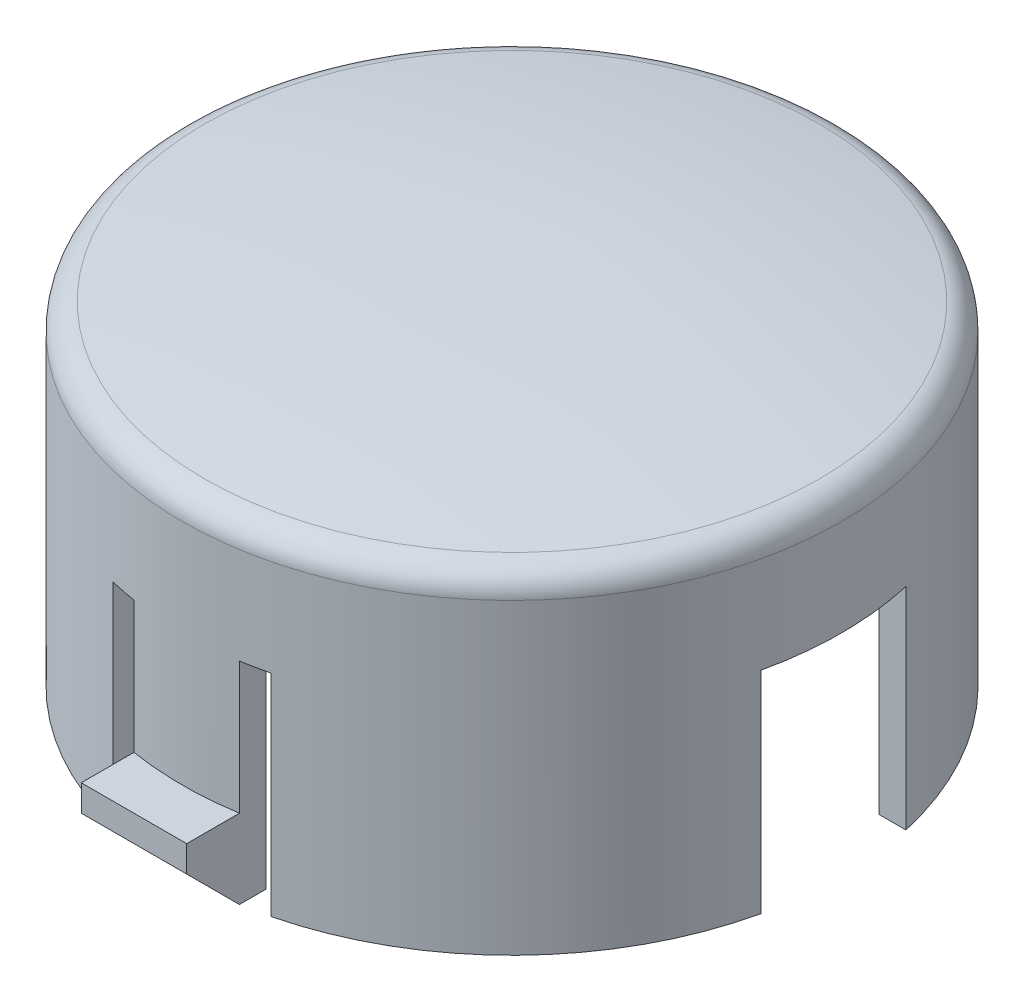
ISO-10303-21;
HEADER;
FILE_DESCRIPTION(('STEP AP214'),'2;1');
FILE_NAME('part.step','',(''),(''),'','','');
FILE_SCHEMA(('AUTOMOTIVE_DESIGN { 1 0 10303 214 1 1 1 1 }'));
ENDSEC;
DATA;
#1=APPLICATION_CONTEXT('core data for automotive mechanical design processes');
#2=APPLICATION_PROTOCOL_DEFINITION('international standard','automotive_design',2000,#1);
#3=PRODUCT_CONTEXT('',#1,'mechanical');
#4=PRODUCT('Part','Part','',(#3));
#5=PRODUCT_RELATED_PRODUCT_CATEGORY('part','',(#4));
#6=PRODUCT_DEFINITION_FORMATION('','',#4);
#7=PRODUCT_DEFINITION_CONTEXT('part definition',#1,'design');
#8=PRODUCT_DEFINITION('design','',#6,#7);
#9=PRODUCT_DEFINITION_SHAPE('','',#8);
#10=(LENGTH_UNIT() NAMED_UNIT(*) SI_UNIT(.MILLI.,.METRE.));
#11=(NAMED_UNIT(*) PLANE_ANGLE_UNIT() SI_UNIT($,.RADIAN.));
#12=(NAMED_UNIT(*) SI_UNIT($,.STERADIAN.) SOLID_ANGLE_UNIT());
#13=UNCERTAINTY_MEASURE_WITH_UNIT(LENGTH_MEASURE(1.E-05),#10,'distance_accuracy_value','');
#14=(GEOMETRIC_REPRESENTATION_CONTEXT(3) GLOBAL_UNCERTAINTY_ASSIGNED_CONTEXT((#13)) GLOBAL_UNIT_ASSIGNED_CONTEXT((#10,
#11,#12)) REPRESENTATION_CONTEXT('',''));
#15=CARTESIAN_POINT('',(0.,0.,0.));
#16=DIRECTION('',(0.,0.,1.));
#17=DIRECTION('',(1.,0.,0.));
#18=AXIS2_PLACEMENT_3D('',#15,#16,#17);
#19=CARTESIAN_POINT('',(11.77826837104,2.624627044438,0.));
#20=CARTESIAN_POINT('',(10.38204791837,2.857662162847,0.));
#21=CARTESIAN_POINT('',(6.476669439017,3.379147885018,0.));
#22=CARTESIAN_POINT('',(2.539001938134,3.542532776364,0.));
#23=CARTESIAN_POINT('',(0.,3.5,0.));
#24=(BOUNDED_CURVE() B_SPLINE_CURVE(3,(#19,#20,#21,#22,#23),.UNSPECIFIED.,.F.,
.F.) B_SPLINE_CURVE_WITH_KNOTS((4,1,4),(0.,0.3585752469358,1.),
.UNSPECIFIED.) CURVE() GEOMETRIC_REPRESENTATION_ITEM() RATIONAL_B_SPLINE_CURVE((1.,1.,1.,1.,1.)) REPRESENTATION_ITEM(''));
#25=CARTESIAN_POINT('',(0.,4.184669438771,0.));
#26=DIRECTION('',(0.,1.,0.));
#27=AXIS1_PLACEMENT('',#25,#26);
#28=SURFACE_OF_REVOLUTION('',#24,#27);
#29=CARTESIAN_POINT('',(0.,3.5,0.));
#30=VERTEX_POINT('',#29);
#31=VERTEX_LOOP('',#30);
#32=FACE_BOUND('',#31,.T.);
#33=CARTESIAN_POINT('',(0.,2.64378334851349,0.));
#34=DIRECTION('',(0.,-1.,0.));
#35=DIRECTION('',(0.999978039651707,0.,0.00662723278067005));
#36=AXIS2_PLACEMENT_3D('',#33,#34,#35);
#37=CIRCLE('',#36,11.6628564969899);
#38=CARTESIAN_POINT('',(11.6626003765992,2.64378334851349,0.0772924648931022));
#39=VERTEX_POINT('',#38);
#40=EDGE_CURVE('E343',#39,#39,#37,.T.);
#41=ORIENTED_EDGE('',*,*,#40,.F.);
#42=EDGE_LOOP('',(#41));
#43=FACE_BOUND('',#42,.T.);
#44=ADVANCED_FACE('F17',(#32,#43),#28,.T.);
#45=CARTESIAN_POINT('',(2.,-10.,14.33896267925));
#46=DIRECTION('',(0.,0.,1.));
#47=DIRECTION('',(1.,0.,0.));
#48=AXIS2_PLACEMENT_3D('',#45,#46,#47);
#49=PLANE('',#48);
#50=DIRECTION('',(0.,1.,0.));
#51=VECTOR('',#50,1.);
#52=CARTESIAN_POINT('',(-2.,-10.,14.33896267925));
#53=LINE('',#52,#51);
#54=CARTESIAN_POINT('',(-2.,-7.,14.33896267925));
#55=VERTEX_POINT('',#54);
#56=CARTESIAN_POINT('',(-2.,-8.,14.33896267925));
#57=VERTEX_POINT('',#56);
#58=EDGE_CURVE('E194',#55,#57,#53,.F.);
#59=ORIENTED_EDGE('',*,*,#58,.T.);
#60=DIRECTION('',(1.,0.,0.));
#61=VECTOR('',#60,1.);
#62=CARTESIAN_POINT('',(0.,-8.,14.33896267925));
#63=LINE('',#62,#61);
#64=CARTESIAN_POINT('',(2.,-8.,14.33896267925));
#65=VERTEX_POINT('',#64);
#66=EDGE_CURVE('E338',#65,#57,#63,.F.);
#67=ORIENTED_EDGE('',*,*,#66,.F.);
#68=DIRECTION('',(0.,1.,0.));
#69=VECTOR('',#68,1.);
#70=CARTESIAN_POINT('',(2.,-10.,14.33896267925));
#71=LINE('',#70,#69);
#72=CARTESIAN_POINT('',(2.,-7.,14.33896267925));
#73=VERTEX_POINT('',#72);
#74=EDGE_CURVE('E209',#65,#73,#71,.T.);
#75=ORIENTED_EDGE('',*,*,#74,.T.);
#76=DIRECTION('',(1.,0.,0.));
#77=VECTOR('',#76,1.);
#78=CARTESIAN_POINT('',(0.,-7.,14.33896267925));
#79=LINE('',#78,#77);
#80=EDGE_CURVE('E336',#73,#55,#79,.F.);
#81=ORIENTED_EDGE('',*,*,#80,.T.);
#82=EDGE_LOOP('',(#59,#67,#75,#81));
#83=FACE_BOUND('',#82,.T.);
#84=ADVANCED_FACE('F377',(#83),#49,.T.);
#85=CARTESIAN_POINT('',(-2.,-10.,-14.33896267925));
#86=DIRECTION('',(0.,0.,-1.));
#87=DIRECTION('',(-1.,0.,0.));
#88=AXIS2_PLACEMENT_3D('',#85,#86,#87);
#89=PLANE('',#88);
#90=DIRECTION('',(0.,1.,0.));
#91=VECTOR('',#90,1.);
#92=CARTESIAN_POINT('',(2.,-10.,-14.33896267925));
#93=LINE('',#92,#91);
#94=CARTESIAN_POINT('',(2.,-7.,-14.33896267925));
#95=VERTEX_POINT('',#94);
#96=CARTESIAN_POINT('',(2.,-8.,-14.33896267925));
#97=VERTEX_POINT('',#96);
#98=EDGE_CURVE('E631',#95,#97,#93,.F.);
#99=ORIENTED_EDGE('',*,*,#98,.T.);
#100=DIRECTION('',(1.,0.,0.));
#101=VECTOR('',#100,1.);
#102=CARTESIAN_POINT('',(0.,-8.,-14.33896267925));
#103=LINE('',#102,#101);
#104=CARTESIAN_POINT('',(-2.,-8.,-14.33896267925));
#105=VERTEX_POINT('',#104);
#106=EDGE_CURVE('E247',#105,#97,#103,.T.);
#107=ORIENTED_EDGE('',*,*,#106,.F.);
#108=DIRECTION('',(0.,1.,0.));
#109=VECTOR('',#108,1.);
#110=CARTESIAN_POINT('',(-2.,-10.,-14.33896267925));
#111=LINE('',#110,#109);
#112=CARTESIAN_POINT('',(-2.,-7.,-14.33896267925));
#113=VERTEX_POINT('',#112);
#114=EDGE_CURVE('E233',#105,#113,#111,.T.);
#115=ORIENTED_EDGE('',*,*,#114,.T.);
#116=DIRECTION('',(1.,0.,0.));
#117=VECTOR('',#116,1.);
#118=CARTESIAN_POINT('',(0.,-7.,-14.33896267925));
#119=LINE('',#118,#117);
#120=EDGE_CURVE('E281',#113,#95,#119,.T.);
#121=ORIENTED_EDGE('',*,*,#120,.T.);
#122=EDGE_LOOP('',(#99,#107,#115,#121));
#123=FACE_BOUND('',#122,.T.);
#124=ADVANCED_FACE('F373',(#123),#89,.T.);
#125=CARTESIAN_POINT('',(0.,1.657133582189,0.));
#126=DIRECTION('',(0.,-1.,0.));
#127=DIRECTION('',(0.999978039651707,0.,0.00662723278067005));
#128=AXIS2_PLACEMENT_3D('',#125,#126,#127);
#129=TOROIDAL_SURFACE('',#128,11.5,1.);
#130=CARTESIAN_POINT('',(0.,1.657133582189,0.));
#131=DIRECTION('',(0.,-1.,0.));
#132=DIRECTION('',(0.,0.,-1.));
#133=AXIS2_PLACEMENT_3D('',#130,#131,#132);
#134=CIRCLE('',#133,12.5);
#135=CARTESIAN_POINT('',(0.,1.657133582189,-12.5));
#136=VERTEX_POINT('',#135);
#137=EDGE_CURVE('E284',#136,#136,#134,.T.);
#138=ORIENTED_EDGE('',*,*,#137,.F.);
#139=EDGE_LOOP('',(#138));
#140=FACE_BOUND('',#139,.T.);
#141=ORIENTED_EDGE('',*,*,#40,.T.);
#142=EDGE_LOOP('',(#141));
#143=FACE_BOUND('',#142,.T.);
#144=ADVANCED_FACE('F368',(#140,#143),#129,.T.);
#145=CARTESIAN_POINT('',(0.,-9.,13.33896267925));
#146=DIRECTION('',(0.,-0.707106781186548,0.707106781186548));
#147=DIRECTION('',(0.,-0.707106781186548,-0.707106781186548));
#148=AXIS2_PLACEMENT_3D('',#145,#146,#147);
#149=PLANE('',#148);
#150=ORIENTED_EDGE('',*,*,#66,.T.);
#151=DIRECTION('',(0.,-0.707106781186547,-0.707106781186548));
#152=VECTOR('',#151,1.);
#153=CARTESIAN_POINT('',(-2.,-8.,14.33896267925));
#154=LINE('',#153,#152);
#155=CARTESIAN_POINT('',(-2.,-10.,12.33896267925));
#156=VERTEX_POINT('',#155);
#157=EDGE_CURVE('E346',#57,#156,#154,.T.);
#158=ORIENTED_EDGE('',*,*,#157,.T.);
#159=DIRECTION('',(1.,0.,0.));
#160=VECTOR('',#159,1.);
#161=CARTESIAN_POINT('',(0.,-10.,12.33896267925));
#162=LINE('',#161,#160);
#163=CARTESIAN_POINT('',(2.,-10.,12.33896267925));
#164=VERTEX_POINT('',#163);
#165=EDGE_CURVE('E216',#164,#156,#162,.F.);
#166=ORIENTED_EDGE('',*,*,#165,.F.);
#167=DIRECTION('',(0.,0.707106781186547,0.707106781186548));
#168=VECTOR('',#167,1.);
#169=CARTESIAN_POINT('',(2.,-10.,12.33896267925));
#170=LINE('',#169,#168);
#171=EDGE_CURVE('E326',#164,#65,#170,.T.);
#172=ORIENTED_EDGE('',*,*,#171,.T.);
#173=EDGE_LOOP('',(#150,#158,#166,#172));
#174=FACE_BOUND('',#173,.T.);
#175=ADVANCED_FACE('F372',(#174),#149,.T.);
#176=CARTESIAN_POINT('',(0.,-7.,0.));
#177=DIRECTION('',(0.,-1.,0.));
#178=DIRECTION('',(0.,0.,-1.));
#179=AXIS2_PLACEMENT_3D('',#176,#177,#178);
#180=PLANE('',#179);
#181=ORIENTED_EDGE('',*,*,#80,.F.);
#182=DIRECTION('',(0.,0.,1.));
#183=VECTOR('',#182,1.);
#184=CARTESIAN_POINT('',(2.,-7.,-18.));
#185=LINE('',#184,#183);
#186=CARTESIAN_POINT('',(2.,-7.,12.3389626792515));
#187=VERTEX_POINT('',#186);
#188=EDGE_CURVE('E324',#73,#187,#185,.F.);
#189=ORIENTED_EDGE('',*,*,#188,.T.);
#190=CARTESIAN_POINT('',(0.,-7.,0.));
#191=DIRECTION('',(0.,-1.,0.));
#192=DIRECTION('',(0.,0.,-1.));
#193=AXIS2_PLACEMENT_3D('',#190,#191,#192);
#194=CIRCLE('',#193,12.5);
#195=CARTESIAN_POINT('',(-2.,-7.,12.3389626792515));
#196=VERTEX_POINT('',#195);
#197=EDGE_CURVE('E21',#196,#187,#194,.F.);
#198=ORIENTED_EDGE('',*,*,#197,.F.);
#199=DIRECTION('',(0.,0.,-1.));
#200=VECTOR('',#199,1.);
#201=CARTESIAN_POINT('',(-2.,-7.,-18.));
#202=LINE('',#201,#200);
#203=EDGE_CURVE('E354',#196,#55,#202,.F.);
#204=ORIENTED_EDGE('',*,*,#203,.T.);
#205=EDGE_LOOP('',(#181,#189,#198,#204));
#206=FACE_BOUND('',#205,.T.);
#207=ADVANCED_FACE('F503',(#206),#180,.F.);
#208=CARTESIAN_POINT('',(0.,-9.,-13.33896267925));
#209=DIRECTION('',(0.,-0.707106781186548,-0.707106781186548));
#210=DIRECTION('',(0.,0.707106781186548,-0.707106781186548));
#211=AXIS2_PLACEMENT_3D('',#208,#209,#210);
#212=PLANE('',#211);
#213=ORIENTED_EDGE('',*,*,#106,.T.);
#214=DIRECTION('',(0.,-0.707106781186548,0.707106781186548));
#215=VECTOR('',#214,1.);
#216=CARTESIAN_POINT('',(2.,-8.,-14.33896267925));
#217=LINE('',#216,#215);
#218=CARTESIAN_POINT('',(2.,-10.,-12.33896267925));
#219=VERTEX_POINT('',#218);
#220=EDGE_CURVE('E244',#97,#219,#217,.T.);
#221=ORIENTED_EDGE('',*,*,#220,.T.);
#222=DIRECTION('',(1.,0.,0.));
#223=VECTOR('',#222,1.);
#224=CARTESIAN_POINT('',(0.,-10.,-12.33896267925));
#225=LINE('',#224,#223);
#226=CARTESIAN_POINT('',(-2.,-10.,-12.33896267925));
#227=VERTEX_POINT('',#226);
#228=EDGE_CURVE('E240',#227,#219,#225,.T.);
#229=ORIENTED_EDGE('',*,*,#228,.F.);
#230=DIRECTION('',(0.,0.707106781186548,-0.707106781186548));
#231=VECTOR('',#230,1.);
#232=CARTESIAN_POINT('',(-2.,-10.,-12.33896267925));
#233=LINE('',#232,#231);
#234=EDGE_CURVE('E266',#227,#105,#233,.T.);
#235=ORIENTED_EDGE('',*,*,#234,.T.);
#236=EDGE_LOOP('',(#213,#221,#229,#235));
#237=FACE_BOUND('',#236,.T.);
#238=ADVANCED_FACE('F246',(#237),#212,.T.);
#239=CARTESIAN_POINT('',(0.,-7.,0.));
#240=DIRECTION('',(0.,-1.,0.));
#241=DIRECTION('',(0.,0.,-1.));
#242=AXIS2_PLACEMENT_3D('',#239,#240,#241);
#243=PLANE('',#242);
#244=ORIENTED_EDGE('',*,*,#120,.F.);
#245=DIRECTION('',(0.,0.,-1.));
#246=VECTOR('',#245,1.);
#247=CARTESIAN_POINT('',(-2.,-7.,-18.));
#248=LINE('',#247,#246);
#249=CARTESIAN_POINT('',(-2.,-7.,-12.3389626792515));
#250=VERTEX_POINT('',#249);
#251=EDGE_CURVE('E268',#113,#250,#248,.F.);
#252=ORIENTED_EDGE('',*,*,#251,.T.);
#253=CARTESIAN_POINT('',(0.,-7.,0.));
#254=DIRECTION('',(0.,-1.,0.));
#255=DIRECTION('',(0.,0.,-1.));
#256=AXIS2_PLACEMENT_3D('',#253,#254,#255);
#257=CIRCLE('',#256,12.5);
#258=CARTESIAN_POINT('',(2.,-7.,-12.3389626792515));
#259=VERTEX_POINT('',#258);
#260=EDGE_CURVE('E316',#259,#250,#257,.F.);
#261=ORIENTED_EDGE('',*,*,#260,.F.);
#262=DIRECTION('',(0.,0.,1.));
#263=VECTOR('',#262,1.);
#264=CARTESIAN_POINT('',(2.,-7.,-18.));
#265=LINE('',#264,#263);
#266=EDGE_CURVE('E261',#259,#95,#265,.F.);
#267=ORIENTED_EDGE('',*,*,#266,.T.);
#268=EDGE_LOOP('',(#244,#252,#261,#267));
#269=FACE_BOUND('',#268,.T.);
#270=ADVANCED_FACE('F497',(#269),#243,.F.);
#271=CARTESIAN_POINT('',(0.,4.184669438771,0.));
#272=DIRECTION('',(0.,-1.,0.));
#273=DIRECTION('',(0.,0.,-1.));
#274=AXIS2_PLACEMENT_3D('',#271,#272,#273);
#275=CYLINDRICAL_SURFACE('',#274,12.5);
#276=ORIENTED_EDGE('',*,*,#137,.T.);
#277=EDGE_LOOP('',(#276));
#278=FACE_BOUND('',#277,.T.);
#279=CARTESIAN_POINT('',(0.,-10.,0.));
#280=DIRECTION('',(0.,-1.,0.));
#281=DIRECTION('',(0.,0.,-1.));
#282=AXIS2_PLACEMENT_3D('',#279,#280,#281);
#283=CIRCLE('',#282,12.5);
#284=CARTESIAN_POINT('',(-12.1937483982586,-10.,-2.75));
#285=VERTEX_POINT('',#284);
#286=CARTESIAN_POINT('',(-3.,-10.,-12.1346610995108));
#287=VERTEX_POINT('',#286);
#288=EDGE_CURVE('E557',#285,#287,#283,.T.);
#289=ORIENTED_EDGE('',*,*,#288,.F.);
#290=DIRECTION('',(0.,1.,0.));
#291=VECTOR('',#290,1.);
#292=CARTESIAN_POINT('',(-12.19374839826,-10.,-2.75));
#293=LINE('',#292,#291);
#294=CARTESIAN_POINT('',(-12.1937483982586,-2.,-2.75));
#295=VERTEX_POINT('',#294);
#296=EDGE_CURVE('E553',#295,#285,#293,.F.);
#297=ORIENTED_EDGE('',*,*,#296,.F.);
#298=CARTESIAN_POINT('',(0.,-2.,0.));
#299=DIRECTION('',(0.,-1.,0.));
#300=DIRECTION('',(0.,0.,-1.));
#301=AXIS2_PLACEMENT_3D('',#298,#299,#300);
#302=CIRCLE('',#301,12.5);
#303=CARTESIAN_POINT('',(-12.1937483982586,-2.,2.75));
#304=VERTEX_POINT('',#303);
#305=EDGE_CURVE('E609',#304,#295,#302,.T.);
#306=ORIENTED_EDGE('',*,*,#305,.F.);
#307=DIRECTION('',(0.,1.,0.));
#308=VECTOR('',#307,1.);
#309=CARTESIAN_POINT('',(-12.19374839826,-2.,2.75));
#310=LINE('',#309,#308);
#311=CARTESIAN_POINT('',(-12.1937483982586,-10.,2.75));
#312=VERTEX_POINT('',#311);
#313=EDGE_CURVE('E312',#312,#304,#310,.T.);
#314=ORIENTED_EDGE('',*,*,#313,.F.);
#315=CARTESIAN_POINT('',(0.,-10.,0.));
#316=DIRECTION('',(0.,-1.,0.));
#317=DIRECTION('',(0.,0.,-1.));
#318=AXIS2_PLACEMENT_3D('',#315,#316,#317);
#319=CIRCLE('',#318,12.5);
#320=CARTESIAN_POINT('',(-3.,-10.,12.1346610995108));
#321=VERTEX_POINT('',#320);
#322=EDGE_CURVE('E315',#321,#312,#319,.T.);
#323=ORIENTED_EDGE('',*,*,#322,.F.);
#324=DIRECTION('',(0.,1.,0.));
#325=VECTOR('',#324,1.);
#326=CARTESIAN_POINT('',(-3.,-2.,12.13466109951));
#327=LINE('',#326,#325);
#328=CARTESIAN_POINT('',(-3.,-2.,12.1346610995108));
#329=VERTEX_POINT('',#328);
#330=EDGE_CURVE('E358',#321,#329,#327,.T.);
#331=ORIENTED_EDGE('',*,*,#330,.T.);
#332=CARTESIAN_POINT('',(0.,-2.,0.));
#333=DIRECTION('',(0.,-1.,0.));
#334=DIRECTION('',(0.,0.,-1.));
#335=AXIS2_PLACEMENT_3D('',#332,#333,#334);
#336=CIRCLE('',#335,12.5);
#337=CARTESIAN_POINT('',(-2.,-2.,12.3389626792515));
#338=VERTEX_POINT('',#337);
#339=EDGE_CURVE('E518',#329,#338,#336,.F.);
#340=ORIENTED_EDGE('',*,*,#339,.T.);
#341=DIRECTION('',(0.,1.,0.));
#342=VECTOR('',#341,1.);
#343=CARTESIAN_POINT('',(-2.,-10.,12.33896267925));
#344=LINE('',#343,#342);
#345=EDGE_CURVE('E352',#338,#196,#344,.F.);
#346=ORIENTED_EDGE('',*,*,#345,.T.);
#347=ORIENTED_EDGE('',*,*,#197,.T.);
#348=DIRECTION('',(0.,1.,0.));
#349=VECTOR('',#348,1.);
#350=CARTESIAN_POINT('',(2.,-2.,12.33896267925));
#351=LINE('',#350,#349);
#352=CARTESIAN_POINT('',(2.,-2.,12.3389626792515));
#353=VERTEX_POINT('',#352);
#354=EDGE_CURVE('E321',#187,#353,#351,.T.);
#355=ORIENTED_EDGE('',*,*,#354,.T.);
#356=CARTESIAN_POINT('',(0.,-2.,0.));
#357=DIRECTION('',(0.,-1.,0.));
#358=DIRECTION('',(0.,0.,-1.));
#359=AXIS2_PLACEMENT_3D('',#356,#357,#358);
#360=CIRCLE('',#359,12.5);
#361=CARTESIAN_POINT('',(3.,-2.,12.1346610995108));
#362=VERTEX_POINT('',#361);
#363=EDGE_CURVE('E514',#353,#362,#360,.F.);
#364=ORIENTED_EDGE('',*,*,#363,.T.);
#365=DIRECTION('',(0.,1.,0.));
#366=VECTOR('',#365,1.);
#367=CARTESIAN_POINT('',(3.,-10.,12.13466109951));
#368=LINE('',#367,#366);
#369=CARTESIAN_POINT('',(3.,-10.,12.1346610995108));
#370=VERTEX_POINT('',#369);
#371=EDGE_CURVE('E317',#362,#370,#368,.F.);
#372=ORIENTED_EDGE('',*,*,#371,.T.);
#373=CARTESIAN_POINT('',(0.,-10.,0.));
#374=DIRECTION('',(0.,-1.,0.));
#375=DIRECTION('',(0.,0.,-1.));
#376=AXIS2_PLACEMENT_3D('',#373,#374,#375);
#377=CIRCLE('',#376,12.5);
#378=CARTESIAN_POINT('',(12.1937483982586,-10.,2.75));
#379=VERTEX_POINT('',#378);
#380=EDGE_CURVE('E620',#379,#370,#377,.T.);
#381=ORIENTED_EDGE('',*,*,#380,.F.);
#382=DIRECTION('',(0.,1.,0.));
#383=VECTOR('',#382,1.);
#384=CARTESIAN_POINT('',(12.19374839826,-2.,2.75));
#385=LINE('',#384,#383);
#386=CARTESIAN_POINT('',(12.1937483982586,-2.,2.75));
#387=VERTEX_POINT('',#386);
#388=EDGE_CURVE('E307',#379,#387,#385,.T.);
#389=ORIENTED_EDGE('',*,*,#388,.T.);
#390=CARTESIAN_POINT('',(0.,-2.,0.));
#391=DIRECTION('',(0.,-1.,0.));
#392=DIRECTION('',(0.,0.,-1.));
#393=AXIS2_PLACEMENT_3D('',#390,#391,#392);
#394=CIRCLE('',#393,12.5);
#395=CARTESIAN_POINT('',(12.1937483982586,-2.,-2.75));
#396=VERTEX_POINT('',#395);
#397=EDGE_CURVE('E605',#387,#396,#394,.F.);
#398=ORIENTED_EDGE('',*,*,#397,.T.);
#399=DIRECTION('',(0.,1.,0.));
#400=VECTOR('',#399,1.);
#401=CARTESIAN_POINT('',(12.19374839826,-10.,-2.75));
#402=LINE('',#401,#400);
#403=CARTESIAN_POINT('',(12.1937483982586,-10.,-2.75));
#404=VERTEX_POINT('',#403);
#405=EDGE_CURVE('E303',#396,#404,#402,.F.);
#406=ORIENTED_EDGE('',*,*,#405,.T.);
#407=CARTESIAN_POINT('',(0.,-10.,0.));
#408=DIRECTION('',(0.,-1.,0.));
#409=DIRECTION('',(0.,0.,-1.));
#410=AXIS2_PLACEMENT_3D('',#407,#408,#409);
#411=CIRCLE('',#410,12.5);
#412=CARTESIAN_POINT('',(3.,-10.,-12.1346610995108));
#413=VERTEX_POINT('',#412);
#414=EDGE_CURVE('E305',#413,#404,#411,.T.);
#415=ORIENTED_EDGE('',*,*,#414,.F.);
#416=DIRECTION('',(0.,1.,0.));
#417=VECTOR('',#416,1.);
#418=CARTESIAN_POINT('',(3.,-10.,-12.13466109951));
#419=LINE('',#418,#417);
#420=CARTESIAN_POINT('',(3.,-2.,-12.1346610995108));
#421=VERTEX_POINT('',#420);
#422=EDGE_CURVE('E299',#413,#421,#419,.T.);
#423=ORIENTED_EDGE('',*,*,#422,.T.);
#424=CARTESIAN_POINT('',(0.,-2.,0.));
#425=DIRECTION('',(0.,-1.,0.));
#426=DIRECTION('',(0.,0.,-1.));
#427=AXIS2_PLACEMENT_3D('',#424,#425,#426);
#428=CIRCLE('',#427,12.5);
#429=CARTESIAN_POINT('',(2.,-2.,-12.3389626792515));
#430=VERTEX_POINT('',#429);
#431=EDGE_CURVE('E301',#421,#430,#428,.F.);
#432=ORIENTED_EDGE('',*,*,#431,.T.);
#433=DIRECTION('',(0.,1.,0.));
#434=VECTOR('',#433,1.);
#435=CARTESIAN_POINT('',(2.,-2.,-12.33896267925));
#436=LINE('',#435,#434);
#437=EDGE_CURVE('E292',#430,#259,#436,.F.);
#438=ORIENTED_EDGE('',*,*,#437,.T.);
#439=ORIENTED_EDGE('',*,*,#260,.T.);
#440=DIRECTION('',(0.,1.,0.));
#441=VECTOR('',#440,1.);
#442=CARTESIAN_POINT('',(-2.,-10.,-12.33896267925));
#443=LINE('',#442,#441);
#444=CARTESIAN_POINT('',(-2.,-2.,-12.3389626792515));
#445=VERTEX_POINT('',#444);
#446=EDGE_CURVE('E272',#250,#445,#443,.T.);
#447=ORIENTED_EDGE('',*,*,#446,.T.);
#448=CARTESIAN_POINT('',(0.,-2.,0.));
#449=DIRECTION('',(0.,-1.,0.));
#450=DIRECTION('',(0.,0.,-1.));
#451=AXIS2_PLACEMENT_3D('',#448,#449,#450);
#452=CIRCLE('',#451,12.5);
#453=CARTESIAN_POINT('',(-3.,-2.,-12.1346610995108));
#454=VERTEX_POINT('',#453);
#455=EDGE_CURVE('E568',#445,#454,#452,.F.);
#456=ORIENTED_EDGE('',*,*,#455,.T.);
#457=DIRECTION('',(0.,1.,0.));
#458=VECTOR('',#457,1.);
#459=CARTESIAN_POINT('',(-3.,-2.,-12.13466109951));
#460=LINE('',#459,#458);
#461=EDGE_CURVE('E556',#454,#287,#460,.F.);
#462=ORIENTED_EDGE('',*,*,#461,.T.);
#463=EDGE_LOOP('',(#289,#297,#306,#314,#323,#331,#340,#346,#347,#355,#364,#372,#381,#389,#398,
#406,#415,#423,#432,#438,#439,#447,#456,#462));
#464=FACE_BOUND('',#463,.T.);
#465=ADVANCED_FACE('F493',(#278,#464),#275,.T.);
#466=CARTESIAN_POINT('',(-5.,-2.,2.75));
#467=DIRECTION('',(0.,0.,-1.));
#468=DIRECTION('',(-1.,0.,0.));
#469=AXIS2_PLACEMENT_3D('',#466,#467,#468);
#470=PLANE('',#469);
#471=ORIENTED_EDGE('',*,*,#313,.T.);
#472=DIRECTION('',(1.,0.,0.));
#473=VECTOR('',#472,1.);
#474=CARTESIAN_POINT('',(-5.,-2.,2.75));
#475=LINE('',#474,#473);
#476=CARTESIAN_POINT('',(-11.1663557170635,-2.,2.75000000000042));
#477=VERTEX_POINT('',#476);
#478=EDGE_CURVE('E555',#477,#304,#475,.F.);
#479=ORIENTED_EDGE('',*,*,#478,.F.);
#480=DIRECTION('',(0.,-1.,0.));
#481=VECTOR('',#480,1.);
#482=CARTESIAN_POINT('',(-11.1663557170634,4.184669438771,2.75000000000085));
#483=LINE('',#482,#481);
#484=CARTESIAN_POINT('',(-11.1663557170635,-10.,2.75000000000042));
#485=VERTEX_POINT('',#484);
#486=EDGE_CURVE('E550',#477,#485,#483,.T.);
#487=ORIENTED_EDGE('',*,*,#486,.T.);
#488=DIRECTION('',(1.,0.,0.));
#489=VECTOR('',#488,1.);
#490=CARTESIAN_POINT('',(0.,-10.,2.75));
#491=LINE('',#490,#489);
#492=EDGE_CURVE('E361',#312,#485,#491,.T.);
#493=ORIENTED_EDGE('',*,*,#492,.F.);
#494=EDGE_LOOP('',(#471,#479,#487,#493));
#495=FACE_BOUND('',#494,.T.);
#496=ADVANCED_FACE('F489',(#495),#470,.T.);
#497=CARTESIAN_POINT('',(0.,-10.,0.));
#498=DIRECTION('',(0.,-1.,0.));
#499=DIRECTION('',(0.,0.,-1.));
#500=AXIS2_PLACEMENT_3D('',#497,#498,#499);
#501=PLANE('',#500);
#502=ORIENTED_EDGE('',*,*,#322,.T.);
#503=ORIENTED_EDGE('',*,*,#492,.T.);
#504=CARTESIAN_POINT('',(0.,-10.,0.));
#505=DIRECTION('',(0.,-1.,0.));
#506=DIRECTION('',(0.,0.,-1.));
#507=AXIS2_PLACEMENT_3D('',#504,#505,#506);
#508=CIRCLE('',#507,11.5);
#509=CARTESIAN_POINT('',(-2.99999999999965,-10.,11.1018016555874));
#510=VERTEX_POINT('',#509);
#511=EDGE_CURVE('E545',#485,#510,#508,.F.);
#512=ORIENTED_EDGE('',*,*,#511,.T.);
#513=DIRECTION('',(0.,0.,1.));
#514=VECTOR('',#513,1.);
#515=CARTESIAN_POINT('',(-3.,-10.,-18.));
#516=LINE('',#515,#514);
#517=EDGE_CURVE('E360',#510,#321,#516,.T.);
#518=ORIENTED_EDGE('',*,*,#517,.T.);
#519=EDGE_LOOP('',(#502,#503,#512,#518));
#520=FACE_BOUND('',#519,.T.);
#521=ADVANCED_FACE('F485',(#520),#501,.T.);
#522=CARTESIAN_POINT('',(-3.,-2.,-18.));
#523=DIRECTION('',(-1.,0.,0.));
#524=DIRECTION('',(0.,0.,1.));
#525=AXIS2_PLACEMENT_3D('',#522,#523,#524);
#526=PLANE('',#525);
#527=DIRECTION('',(0.,-1.,0.));
#528=VECTOR('',#527,1.);
#529=CARTESIAN_POINT('',(-2.99999999999931,4.184669438771,11.1018016555874));
#530=LINE('',#529,#528);
#531=CARTESIAN_POINT('',(-2.99999999999965,-2.,11.1018016555874));
#532=VERTEX_POINT('',#531);
#533=EDGE_CURVE('E536',#510,#532,#530,.F.);
#534=ORIENTED_EDGE('',*,*,#533,.T.);
#535=DIRECTION('',(0.,0.,1.));
#536=VECTOR('',#535,1.);
#537=CARTESIAN_POINT('',(-3.,-2.,-18.));
#538=LINE('',#537,#536);
#539=EDGE_CURVE('E349',#532,#329,#538,.T.);
#540=ORIENTED_EDGE('',*,*,#539,.T.);
#541=ORIENTED_EDGE('',*,*,#330,.F.);
#542=ORIENTED_EDGE('',*,*,#517,.F.);
#543=EDGE_LOOP('',(#534,#540,#541,#542));
#544=FACE_BOUND('',#543,.T.);
#545=ADVANCED_FACE('F481',(#544),#526,.F.);
#546=CARTESIAN_POINT('',(-2.,-2.,-18.));
#547=DIRECTION('',(0.,1.,0.));
#548=DIRECTION('',(0.,0.,1.));
#549=AXIS2_PLACEMENT_3D('',#546,#547,#548);
#550=PLANE('',#549);
#551=CARTESIAN_POINT('',(0.,-2.,0.));
#552=DIRECTION('',(0.,-1.,0.));
#553=DIRECTION('',(0.,0.,-1.));
#554=AXIS2_PLACEMENT_3D('',#551,#552,#553);
#555=CIRCLE('',#554,11.5);
#556=CARTESIAN_POINT('',(-1.99999999999967,-2.,11.3247516529062));
#557=VERTEX_POINT('',#556);
#558=EDGE_CURVE('E530',#532,#557,#555,.F.);
#559=ORIENTED_EDGE('',*,*,#558,.T.);
#560=DIRECTION('',(0.,0.,-1.));
#561=VECTOR('',#560,1.);
#562=CARTESIAN_POINT('',(-2.,-2.,-18.));
#563=LINE('',#562,#561);
#564=EDGE_CURVE('E348',#557,#338,#563,.F.);
#565=ORIENTED_EDGE('',*,*,#564,.T.);
#566=ORIENTED_EDGE('',*,*,#339,.F.);
#567=ORIENTED_EDGE('',*,*,#539,.F.);
#568=EDGE_LOOP('',(#559,#565,#566,#567));
#569=FACE_BOUND('',#568,.T.);
#570=ADVANCED_FACE('F478',(#569),#550,.F.);
#571=CARTESIAN_POINT('',(-2.,-10.,-18.));
#572=DIRECTION('',(1.,0.,0.));
#573=DIRECTION('',(0.,0.,-1.));
#574=AXIS2_PLACEMENT_3D('',#571,#572,#573);
#575=PLANE('',#574);
#576=ORIENTED_EDGE('',*,*,#203,.F.);
#577=ORIENTED_EDGE('',*,*,#345,.F.);
#578=ORIENTED_EDGE('',*,*,#564,.F.);
#579=DIRECTION('',(0.,-1.,0.));
#580=VECTOR('',#579,1.);
#581=CARTESIAN_POINT('',(-1.99999999999933,4.184669438771,11.3247516529062));
#582=LINE('',#581,#580);
#583=CARTESIAN_POINT('',(-1.99999999999967,-10.,11.3247516529062));
#584=VERTEX_POINT('',#583);
#585=EDGE_CURVE('E523',#557,#584,#582,.T.);
#586=ORIENTED_EDGE('',*,*,#585,.T.);
#587=DIRECTION('',(0.,0.,-1.));
#588=VECTOR('',#587,1.);
#589=CARTESIAN_POINT('',(-2.,-10.,0.));
#590=LINE('',#589,#588);
#591=EDGE_CURVE('E327',#156,#584,#590,.T.);
#592=ORIENTED_EDGE('',*,*,#591,.F.);
#593=ORIENTED_EDGE('',*,*,#157,.F.);
#594=ORIENTED_EDGE('',*,*,#58,.F.);
#595=EDGE_LOOP('',(#576,#577,#578,#586,#592,#593,#594));
#596=FACE_BOUND('',#595,.T.);
#597=ADVANCED_FACE('F474',(#596),#575,.F.);
#598=CARTESIAN_POINT('',(0.,-10.,0.));
#599=DIRECTION('',(0.,-1.,0.));
#600=DIRECTION('',(0.,0.,-1.));
#601=AXIS2_PLACEMENT_3D('',#598,#599,#600);
#602=PLANE('',#601);
#603=DIRECTION('',(0.,0.,1.));
#604=VECTOR('',#603,1.);
#605=CARTESIAN_POINT('',(2.,-10.,-18.));
#606=LINE('',#605,#604);
#607=CARTESIAN_POINT('',(1.99999999999967,-10.,11.3247516529062));
#608=VERTEX_POINT('',#607);
#609=EDGE_CURVE('E323',#608,#164,#606,.T.);
#610=ORIENTED_EDGE('',*,*,#609,.T.);
#611=ORIENTED_EDGE('',*,*,#165,.T.);
#612=ORIENTED_EDGE('',*,*,#591,.T.);
#613=CARTESIAN_POINT('',(0.,-10.,0.));
#614=DIRECTION('',(0.,-1.,0.));
#615=DIRECTION('',(0.,0.,-1.));
#616=AXIS2_PLACEMENT_3D('',#613,#614,#615);
#617=CIRCLE('',#616,11.5);
#618=EDGE_CURVE('E532',#584,#608,#617,.F.);
#619=ORIENTED_EDGE('',*,*,#618,.T.);
#620=EDGE_LOOP('',(#610,#611,#612,#619));
#621=FACE_BOUND('',#620,.T.);
#622=ADVANCED_FACE('F471',(#621),#602,.T.);
#623=CARTESIAN_POINT('',(2.,-2.,-18.));
#624=DIRECTION('',(-1.,0.,0.));
#625=DIRECTION('',(0.,0.,1.));
#626=AXIS2_PLACEMENT_3D('',#623,#624,#625);
#627=PLANE('',#626);
#628=DIRECTION('',(0.,-1.,0.));
#629=VECTOR('',#628,1.);
#630=CARTESIAN_POINT('',(1.99999999999934,4.184669438771,11.3247516529062));
#631=LINE('',#630,#629);
#632=CARTESIAN_POINT('',(1.99999999999967,-2.,11.3247516529062));
#633=VERTEX_POINT('',#632);
#634=EDGE_CURVE('E534',#608,#633,#631,.F.);
#635=ORIENTED_EDGE('',*,*,#634,.T.);
#636=DIRECTION('',(0.,0.,1.));
#637=VECTOR('',#636,1.);
#638=CARTESIAN_POINT('',(2.,-2.,-18.));
#639=LINE('',#638,#637);
#640=EDGE_CURVE('E320',#633,#353,#639,.T.);
#641=ORIENTED_EDGE('',*,*,#640,.T.);
#642=ORIENTED_EDGE('',*,*,#354,.F.);
#643=ORIENTED_EDGE('',*,*,#188,.F.);
#644=ORIENTED_EDGE('',*,*,#74,.F.);
#645=ORIENTED_EDGE('',*,*,#171,.F.);
#646=ORIENTED_EDGE('',*,*,#609,.F.);
#647=EDGE_LOOP('',(#635,#641,#642,#643,#644,#645,#646));
#648=FACE_BOUND('',#647,.T.);
#649=ADVANCED_FACE('F467',(#648),#627,.F.);
#650=CARTESIAN_POINT('',(3.,-2.,-18.));
#651=DIRECTION('',(0.,1.,0.));
#652=DIRECTION('',(0.,0.,1.));
#653=AXIS2_PLACEMENT_3D('',#650,#651,#652);
#654=PLANE('',#653);
#655=CARTESIAN_POINT('',(0.,-2.,0.));
#656=DIRECTION('',(0.,-1.,0.));
#657=DIRECTION('',(0.,0.,-1.));
#658=AXIS2_PLACEMENT_3D('',#655,#656,#657);
#659=CIRCLE('',#658,11.5);
#660=CARTESIAN_POINT('',(2.99999999999965,-2.,11.1018016555874));
#661=VERTEX_POINT('',#660);
#662=EDGE_CURVE('E623',#633,#661,#659,.F.);
#663=ORIENTED_EDGE('',*,*,#662,.T.);
#664=DIRECTION('',(0.,0.,-1.));
#665=VECTOR('',#664,1.);
#666=CARTESIAN_POINT('',(3.,-2.,-18.));
#667=LINE('',#666,#665);
#668=EDGE_CURVE('E319',#661,#362,#667,.F.);
#669=ORIENTED_EDGE('',*,*,#668,.T.);
#670=ORIENTED_EDGE('',*,*,#363,.F.);
#671=ORIENTED_EDGE('',*,*,#640,.F.);
#672=EDGE_LOOP('',(#663,#669,#670,#671));
#673=FACE_BOUND('',#672,.T.);
#674=ADVANCED_FACE('F463',(#673),#654,.F.);
#675=CARTESIAN_POINT('',(3.,-10.,-18.));
#676=DIRECTION('',(1.,0.,0.));
#677=DIRECTION('',(0.,0.,-1.));
#678=AXIS2_PLACEMENT_3D('',#675,#676,#677);
#679=PLANE('',#678);
#680=DIRECTION('',(0.,-1.,0.));
#681=VECTOR('',#680,1.);
#682=CARTESIAN_POINT('',(2.99999999999931,4.184669438771,11.1018016555874));
#683=LINE('',#682,#681);
#684=CARTESIAN_POINT('',(2.99999999999965,-10.,11.1018016555874));
#685=VERTEX_POINT('',#684);
#686=EDGE_CURVE('E621',#661,#685,#683,.T.);
#687=ORIENTED_EDGE('',*,*,#686,.T.);
#688=DIRECTION('',(0.,0.,-1.));
#689=VECTOR('',#688,1.);
#690=CARTESIAN_POINT('',(3.,-10.,0.));
#691=LINE('',#690,#689);
#692=EDGE_CURVE('E311',#370,#685,#691,.T.);
#693=ORIENTED_EDGE('',*,*,#692,.F.);
#694=ORIENTED_EDGE('',*,*,#371,.F.);
#695=ORIENTED_EDGE('',*,*,#668,.F.);
#696=EDGE_LOOP('',(#687,#693,#694,#695));
#697=FACE_BOUND('',#696,.T.);
#698=ADVANCED_FACE('F459',(#697),#679,.F.);
#699=CARTESIAN_POINT('',(0.,-10.,0.));
#700=DIRECTION('',(0.,-1.,0.));
#701=DIRECTION('',(0.,0.,-1.));
#702=AXIS2_PLACEMENT_3D('',#699,#700,#701);
#703=PLANE('',#702);
#704=CARTESIAN_POINT('',(0.,-10.,0.));
#705=DIRECTION('',(0.,-1.,0.));
#706=DIRECTION('',(0.,0.,-1.));
#707=AXIS2_PLACEMENT_3D('',#704,#705,#706);
#708=CIRCLE('',#707,11.5);
#709=CARTESIAN_POINT('',(11.1663557170635,-10.,2.75000000000042));
#710=VERTEX_POINT('',#709);
#711=EDGE_CURVE('E615',#685,#710,#708,.F.);
#712=ORIENTED_EDGE('',*,*,#711,.T.);
#713=DIRECTION('',(1.,0.,0.));
#714=VECTOR('',#713,1.);
#715=CARTESIAN_POINT('',(5.,-10.,2.75));
#716=LINE('',#715,#714);
#717=EDGE_CURVE('E310',#710,#379,#716,.T.);
#718=ORIENTED_EDGE('',*,*,#717,.T.);
#719=ORIENTED_EDGE('',*,*,#380,.T.);
#720=ORIENTED_EDGE('',*,*,#692,.T.);
#721=EDGE_LOOP('',(#712,#718,#719,#720));
#722=FACE_BOUND('',#721,.T.);
#723=ADVANCED_FACE('F455',(#722),#703,.T.);
#724=CARTESIAN_POINT('',(5.,-2.,2.75));
#725=DIRECTION('',(0.,0.,1.));
#726=DIRECTION('',(1.,0.,0.));
#727=AXIS2_PLACEMENT_3D('',#724,#725,#726);
#728=PLANE('',#727);
#729=DIRECTION('',(0.,-1.,0.));
#730=VECTOR('',#729,1.);
#731=CARTESIAN_POINT('',(11.1663557170634,4.184669438771,2.75000000000085));
#732=LINE('',#731,#730);
#733=CARTESIAN_POINT('',(11.1663557170635,-2.,2.75000000000042));
#734=VERTEX_POINT('',#733);
#735=EDGE_CURVE('E612',#710,#734,#732,.F.);
#736=ORIENTED_EDGE('',*,*,#735,.T.);
#737=DIRECTION('',(1.,0.,0.));
#738=VECTOR('',#737,1.);
#739=CARTESIAN_POINT('',(5.,-2.,2.75));
#740=LINE('',#739,#738);
#741=EDGE_CURVE('E602',#734,#387,#740,.T.);
#742=ORIENTED_EDGE('',*,*,#741,.T.);
#743=ORIENTED_EDGE('',*,*,#388,.F.);
#744=ORIENTED_EDGE('',*,*,#717,.F.);
#745=EDGE_LOOP('',(#736,#742,#743,#744));
#746=FACE_BOUND('',#745,.T.);
#747=ADVANCED_FACE('F451',(#746),#728,.F.);
#748=CARTESIAN_POINT('',(-5.,-10.,-2.75));
#749=DIRECTION('',(0.,0.,1.));
#750=DIRECTION('',(1.,0.,0.));
#751=AXIS2_PLACEMENT_3D('',#748,#749,#750);
#752=PLANE('',#751);
#753=DIRECTION('',(0.,-1.,0.));
#754=VECTOR('',#753,1.);
#755=CARTESIAN_POINT('',(-11.1663557170634,4.184669438771,-2.75000000000084));
#756=LINE('',#755,#754);
#757=CARTESIAN_POINT('',(-11.1663557170635,-10.,-2.75000000000042));
#758=VERTEX_POINT('',#757);
#759=CARTESIAN_POINT('',(-11.1663557170635,-2.,-2.75000000000042));
#760=VERTEX_POINT('',#759);
#761=EDGE_CURVE('E571',#758,#760,#756,.F.);
#762=ORIENTED_EDGE('',*,*,#761,.T.);
#763=DIRECTION('',(1.,0.,0.));
#764=VECTOR('',#763,1.);
#765=CARTESIAN_POINT('',(-5.,-2.,-2.75));
#766=LINE('',#765,#764);
#767=EDGE_CURVE('E606',#295,#760,#766,.T.);
#768=ORIENTED_EDGE('',*,*,#767,.F.);
#769=ORIENTED_EDGE('',*,*,#296,.T.);
#770=DIRECTION('',(1.,0.,0.));
#771=VECTOR('',#770,1.);
#772=CARTESIAN_POINT('',(0.,-10.,-2.75));
#773=LINE('',#772,#771);
#774=EDGE_CURVE('E552',#758,#285,#773,.F.);
#775=ORIENTED_EDGE('',*,*,#774,.F.);
#776=EDGE_LOOP('',(#762,#768,#769,#775));
#777=FACE_BOUND('',#776,.T.);
#778=ADVANCED_FACE('F447',(#777),#752,.T.);
#779=CARTESIAN_POINT('',(-5.,-2.,-2.75));
#780=DIRECTION('',(0.,-1.,0.));
#781=DIRECTION('',(0.,0.,-1.));
#782=AXIS2_PLACEMENT_3D('',#779,#780,#781);
#783=PLANE('',#782);
#784=ORIENTED_EDGE('',*,*,#305,.T.);
#785=ORIENTED_EDGE('',*,*,#767,.T.);
#786=CARTESIAN_POINT('',(0.,-2.,0.));
#787=DIRECTION('',(0.,-1.,0.));
#788=DIRECTION('',(0.,0.,-1.));
#789=AXIS2_PLACEMENT_3D('',#786,#787,#788);
#790=CIRCLE('',#789,11.5);
#791=EDGE_CURVE('E659',#760,#477,#790,.F.);
#792=ORIENTED_EDGE('',*,*,#791,.T.);
#793=ORIENTED_EDGE('',*,*,#478,.T.);
#794=EDGE_LOOP('',(#784,#785,#792,#793));
#795=FACE_BOUND('',#794,.T.);
#796=ADVANCED_FACE('F443',(#795),#783,.T.);
#797=CARTESIAN_POINT('',(5.,-2.,-2.75));
#798=DIRECTION('',(0.,1.,0.));
#799=DIRECTION('',(0.,0.,1.));
#800=AXIS2_PLACEMENT_3D('',#797,#798,#799);
#801=PLANE('',#800);
#802=ORIENTED_EDGE('',*,*,#741,.F.);
#803=CARTESIAN_POINT('',(0.,-2.,0.));
#804=DIRECTION('',(0.,-1.,0.));
#805=DIRECTION('',(0.,0.,-1.));
#806=AXIS2_PLACEMENT_3D('',#803,#804,#805);
#807=CIRCLE('',#806,11.5);
#808=CARTESIAN_POINT('',(11.1663557170635,-2.,-2.75000000000042));
#809=VERTEX_POINT('',#808);
#810=EDGE_CURVE('E599',#734,#809,#807,.F.);
#811=ORIENTED_EDGE('',*,*,#810,.T.);
#812=DIRECTION('',(-1.,0.,0.));
#813=VECTOR('',#812,1.);
#814=CARTESIAN_POINT('',(5.,-2.,-2.75));
#815=LINE('',#814,#813);
#816=EDGE_CURVE('E306',#809,#396,#815,.F.);
#817=ORIENTED_EDGE('',*,*,#816,.T.);
#818=ORIENTED_EDGE('',*,*,#397,.F.);
#819=EDGE_LOOP('',(#802,#811,#817,#818));
#820=FACE_BOUND('',#819,.T.);
#821=ADVANCED_FACE('F439',(#820),#801,.F.);
#822=CARTESIAN_POINT('',(5.,-10.,-2.75));
#823=DIRECTION('',(0.,0.,-1.));
#824=DIRECTION('',(-1.,0.,0.));
#825=AXIS2_PLACEMENT_3D('',#822,#823,#824);
#826=PLANE('',#825);
#827=ORIENTED_EDGE('',*,*,#816,.F.);
#828=DIRECTION('',(0.,-1.,0.));
#829=VECTOR('',#828,1.);
#830=CARTESIAN_POINT('',(11.1663557170634,4.184669438771,-2.75000000000085));
#831=LINE('',#830,#829);
#832=CARTESIAN_POINT('',(11.1663557170635,-10.,-2.75000000000042));
#833=VERTEX_POINT('',#832);
#834=EDGE_CURVE('E597',#809,#833,#831,.T.);
#835=ORIENTED_EDGE('',*,*,#834,.T.);
#836=DIRECTION('',(1.,0.,0.));
#837=VECTOR('',#836,1.);
#838=CARTESIAN_POINT('',(0.,-10.,-2.75));
#839=LINE('',#838,#837);
#840=EDGE_CURVE('E594',#404,#833,#839,.F.);
#841=ORIENTED_EDGE('',*,*,#840,.F.);
#842=ORIENTED_EDGE('',*,*,#405,.F.);
#843=EDGE_LOOP('',(#827,#835,#841,#842));
#844=FACE_BOUND('',#843,.T.);
#845=ADVANCED_FACE('F435',(#844),#826,.F.);
#846=CARTESIAN_POINT('',(0.,-10.,0.));
#847=DIRECTION('',(0.,-1.,0.));
#848=DIRECTION('',(0.,0.,-1.));
#849=AXIS2_PLACEMENT_3D('',#846,#847,#848);
#850=PLANE('',#849);
#851=ORIENTED_EDGE('',*,*,#414,.T.);
#852=ORIENTED_EDGE('',*,*,#840,.T.);
#853=CARTESIAN_POINT('',(0.,-10.,0.));
#854=DIRECTION('',(0.,-1.,0.));
#855=DIRECTION('',(0.,0.,-1.));
#856=AXIS2_PLACEMENT_3D('',#853,#854,#855);
#857=CIRCLE('',#856,11.5);
#858=CARTESIAN_POINT('',(2.99999999999965,-10.,-11.1018016555874));
#859=VERTEX_POINT('',#858);
#860=EDGE_CURVE('E591',#833,#859,#857,.F.);
#861=ORIENTED_EDGE('',*,*,#860,.T.);
#862=DIRECTION('',(0.,0.,-1.));
#863=VECTOR('',#862,1.);
#864=CARTESIAN_POINT('',(3.,-10.,-18.));
#865=LINE('',#864,#863);
#866=EDGE_CURVE('E302',#859,#413,#865,.T.);
#867=ORIENTED_EDGE('',*,*,#866,.T.);
#868=EDGE_LOOP('',(#851,#852,#861,#867));
#869=FACE_BOUND('',#868,.T.);
#870=ADVANCED_FACE('F431',(#869),#850,.T.);
#871=CARTESIAN_POINT('',(3.,-10.,-18.));
#872=DIRECTION('',(1.,0.,0.));
#873=DIRECTION('',(0.,0.,-1.));
#874=AXIS2_PLACEMENT_3D('',#871,#872,#873);
#875=PLANE('',#874);
#876=DIRECTION('',(0.,0.,1.));
#877=VECTOR('',#876,1.);
#878=CARTESIAN_POINT('',(3.,-2.,-18.));
#879=LINE('',#878,#877);
#880=CARTESIAN_POINT('',(2.99999999999965,-2.,-11.1018016555874));
#881=VERTEX_POINT('',#880);
#882=EDGE_CURVE('E250',#881,#421,#879,.F.);
#883=ORIENTED_EDGE('',*,*,#882,.T.);
#884=ORIENTED_EDGE('',*,*,#422,.F.);
#885=ORIENTED_EDGE('',*,*,#866,.F.);
#886=DIRECTION('',(0.,-1.,0.));
#887=VECTOR('',#886,1.);
#888=CARTESIAN_POINT('',(2.99999999999931,4.184669438771,-11.1018016555874));
#889=LINE('',#888,#887);
#890=EDGE_CURVE('E589',#859,#881,#889,.F.);
#891=ORIENTED_EDGE('',*,*,#890,.T.);
#892=EDGE_LOOP('',(#883,#884,#885,#891));
#893=FACE_BOUND('',#892,.T.);
#894=ADVANCED_FACE('F427',(#893),#875,.F.);
#895=CARTESIAN_POINT('',(3.,-2.,-18.));
#896=DIRECTION('',(0.,1.,0.));
#897=DIRECTION('',(0.,0.,1.));
#898=AXIS2_PLACEMENT_3D('',#895,#896,#897);
#899=PLANE('',#898);
#900=CARTESIAN_POINT('',(0.,-2.,0.));
#901=DIRECTION('',(0.,-1.,0.));
#902=DIRECTION('',(0.,0.,-1.));
#903=AXIS2_PLACEMENT_3D('',#900,#901,#902);
#904=CIRCLE('',#903,11.5);
#905=CARTESIAN_POINT('',(1.99999999999967,-2.,-11.3247516529062));
#906=VERTEX_POINT('',#905);
#907=EDGE_CURVE('E584',#881,#906,#904,.F.);
#908=ORIENTED_EDGE('',*,*,#907,.T.);
#909=DIRECTION('',(0.,0.,1.));
#910=VECTOR('',#909,1.);
#911=CARTESIAN_POINT('',(2.,-2.,-18.));
#912=LINE('',#911,#910);
#913=EDGE_CURVE('E249',#906,#430,#912,.F.);
#914=ORIENTED_EDGE('',*,*,#913,.T.);
#915=ORIENTED_EDGE('',*,*,#431,.F.);
#916=ORIENTED_EDGE('',*,*,#882,.F.);
#917=EDGE_LOOP('',(#908,#914,#915,#916));
#918=FACE_BOUND('',#917,.T.);
#919=ADVANCED_FACE('F424',(#918),#899,.F.);
#920=CARTESIAN_POINT('',(2.,-2.,-18.));
#921=DIRECTION('',(-1.,0.,0.));
#922=DIRECTION('',(0.,0.,1.));
#923=AXIS2_PLACEMENT_3D('',#920,#921,#922);
#924=PLANE('',#923);
#925=ORIENTED_EDGE('',*,*,#266,.F.);
#926=ORIENTED_EDGE('',*,*,#437,.F.);
#927=ORIENTED_EDGE('',*,*,#913,.F.);
#928=DIRECTION('',(0.,-1.,0.));
#929=VECTOR('',#928,1.);
#930=CARTESIAN_POINT('',(1.99999999999934,4.184669438771,-11.3247516529062));
#931=LINE('',#930,#929);
#932=CARTESIAN_POINT('',(1.99999999999967,-10.,-11.3247516529062));
#933=VERTEX_POINT('',#932);
#934=EDGE_CURVE('E258',#906,#933,#931,.T.);
#935=ORIENTED_EDGE('',*,*,#934,.T.);
#936=DIRECTION('',(0.,0.,-1.));
#937=VECTOR('',#936,1.);
#938=CARTESIAN_POINT('',(2.,-10.,0.));
#939=LINE('',#938,#937);
#940=EDGE_CURVE('E253',#219,#933,#939,.F.);
#941=ORIENTED_EDGE('',*,*,#940,.F.);
#942=ORIENTED_EDGE('',*,*,#220,.F.);
#943=ORIENTED_EDGE('',*,*,#98,.F.);
#944=EDGE_LOOP('',(#925,#926,#927,#935,#941,#942,#943));
#945=FACE_BOUND('',#944,.T.);
#946=ADVANCED_FACE('F255',(#945),#924,.F.);
#947=CARTESIAN_POINT('',(0.,-10.,0.));
#948=DIRECTION('',(0.,-1.,0.));
#949=DIRECTION('',(0.,0.,-1.));
#950=AXIS2_PLACEMENT_3D('',#947,#948,#949);
#951=PLANE('',#950);
#952=DIRECTION('',(0.,0.,-1.));
#953=VECTOR('',#952,1.);
#954=CARTESIAN_POINT('',(-2.,-10.,-18.));
#955=LINE('',#954,#953);
#956=CARTESIAN_POINT('',(-1.99999999999967,-10.,-11.3247516529062));
#957=VERTEX_POINT('',#956);
#958=EDGE_CURVE('E265',#957,#227,#955,.T.);
#959=ORIENTED_EDGE('',*,*,#958,.T.);
#960=ORIENTED_EDGE('',*,*,#228,.T.);
#961=ORIENTED_EDGE('',*,*,#940,.T.);
#962=CARTESIAN_POINT('',(0.,-10.,0.));
#963=DIRECTION('',(0.,-1.,0.));
#964=DIRECTION('',(0.,0.,-1.));
#965=AXIS2_PLACEMENT_3D('',#962,#963,#964);
#966=CIRCLE('',#965,11.5);
#967=EDGE_CURVE('E577',#933,#957,#966,.F.);
#968=ORIENTED_EDGE('',*,*,#967,.T.);
#969=EDGE_LOOP('',(#959,#960,#961,#968));
#970=FACE_BOUND('',#969,.T.);
#971=ADVANCED_FACE('F263',(#970),#951,.T.);
#972=CARTESIAN_POINT('',(-2.,-10.,-18.));
#973=DIRECTION('',(1.,0.,0.));
#974=DIRECTION('',(0.,0.,-1.));
#975=AXIS2_PLACEMENT_3D('',#972,#973,#974);
#976=PLANE('',#975);
#977=DIRECTION('',(0.,-1.,0.));
#978=VECTOR('',#977,1.);
#979=CARTESIAN_POINT('',(-1.99999999999934,4.184669438771,-11.3247516529062));
#980=LINE('',#979,#978);
#981=CARTESIAN_POINT('',(-1.99999999999967,-2.,-11.3247516529062));
#982=VERTEX_POINT('',#981);
#983=EDGE_CURVE('E574',#957,#982,#980,.F.);
#984=ORIENTED_EDGE('',*,*,#983,.T.);
#985=DIRECTION('',(0.,0.,1.));
#986=VECTOR('',#985,1.);
#987=CARTESIAN_POINT('',(-2.,-2.,-18.));
#988=LINE('',#987,#986);
#989=EDGE_CURVE('E564',#982,#445,#988,.F.);
#990=ORIENTED_EDGE('',*,*,#989,.T.);
#991=ORIENTED_EDGE('',*,*,#446,.F.);
#992=ORIENTED_EDGE('',*,*,#251,.F.);
#993=ORIENTED_EDGE('',*,*,#114,.F.);
#994=ORIENTED_EDGE('',*,*,#234,.F.);
#995=ORIENTED_EDGE('',*,*,#958,.F.);
#996=EDGE_LOOP('',(#984,#990,#991,#992,#993,#994,#995));
#997=FACE_BOUND('',#996,.T.);
#998=ADVANCED_FACE('F416',(#997),#976,.F.);
#999=CARTESIAN_POINT('',(-2.,-2.,-18.));
#1000=DIRECTION('',(0.,1.,0.));
#1001=DIRECTION('',(0.,0.,1.));
#1002=AXIS2_PLACEMENT_3D('',#999,#1000,#1001);
#1003=PLANE('',#1002);
#1004=CARTESIAN_POINT('',(0.,-2.,0.));
#1005=DIRECTION('',(0.,-1.,0.));
#1006=DIRECTION('',(0.,0.,-1.));
#1007=AXIS2_PLACEMENT_3D('',#1004,#1005,#1006);
#1008=CIRCLE('',#1007,11.5);
#1009=CARTESIAN_POINT('',(-2.99999999999966,-2.,-11.1018016555873));
#1010=VERTEX_POINT('',#1009);
#1011=EDGE_CURVE('E576',#982,#1010,#1008,.F.);
#1012=ORIENTED_EDGE('',*,*,#1011,.T.);
#1013=DIRECTION('',(0.,0.,1.));
#1014=VECTOR('',#1013,1.);
#1015=CARTESIAN_POINT('',(-3.,-2.,-18.));
#1016=LINE('',#1015,#1014);
#1017=EDGE_CURVE('E558',#1010,#454,#1016,.F.);
#1018=ORIENTED_EDGE('',*,*,#1017,.T.);
#1019=ORIENTED_EDGE('',*,*,#455,.F.);
#1020=ORIENTED_EDGE('',*,*,#989,.F.);
#1021=EDGE_LOOP('',(#1012,#1018,#1019,#1020));
#1022=FACE_BOUND('',#1021,.T.);
#1023=ADVANCED_FACE('F413',(#1022),#1003,.F.);
#1024=CARTESIAN_POINT('',(-3.,-2.,-18.));
#1025=DIRECTION('',(-1.,0.,0.));
#1026=DIRECTION('',(0.,0.,1.));
#1027=AXIS2_PLACEMENT_3D('',#1024,#1025,#1026);
#1028=PLANE('',#1027);
#1029=ORIENTED_EDGE('',*,*,#1017,.F.);
#1030=DIRECTION('',(0.,-1.,0.));
#1031=VECTOR('',#1030,1.);
#1032=CARTESIAN_POINT('',(-2.99999999999931,4.184669438771,-11.1018016555874));
#1033=LINE('',#1032,#1031);
#1034=CARTESIAN_POINT('',(-2.99999999999966,-10.,-11.1018016555873));
#1035=VERTEX_POINT('',#1034);
#1036=EDGE_CURVE('E36',#1010,#1035,#1033,.T.);
#1037=ORIENTED_EDGE('',*,*,#1036,.T.);
#1038=DIRECTION('',(0.,0.,-1.));
#1039=VECTOR('',#1038,1.);
#1040=CARTESIAN_POINT('',(-3.,-10.,0.));
#1041=LINE('',#1040,#1039);
#1042=EDGE_CURVE('E561',#287,#1035,#1041,.F.);
#1043=ORIENTED_EDGE('',*,*,#1042,.F.);
#1044=ORIENTED_EDGE('',*,*,#461,.F.);
#1045=EDGE_LOOP('',(#1029,#1037,#1043,#1044));
#1046=FACE_BOUND('',#1045,.T.);
#1047=ADVANCED_FACE('F409',(#1046),#1028,.F.);
#1048=CARTESIAN_POINT('',(0.,-10.,0.));
#1049=DIRECTION('',(0.,-1.,0.));
#1050=DIRECTION('',(0.,0.,-1.));
#1051=AXIS2_PLACEMENT_3D('',#1048,#1049,#1050);
#1052=PLANE('',#1051);
#1053=CARTESIAN_POINT('',(0.,-10.,0.));
#1054=DIRECTION('',(0.,-1.,0.));
#1055=DIRECTION('',(0.,0.,-1.));
#1056=AXIS2_PLACEMENT_3D('',#1053,#1054,#1055);
#1057=CIRCLE('',#1056,11.5);
#1058=EDGE_CURVE('E651',#1035,#758,#1057,.F.);
#1059=ORIENTED_EDGE('',*,*,#1058,.T.);
#1060=ORIENTED_EDGE('',*,*,#774,.T.);
#1061=ORIENTED_EDGE('',*,*,#288,.T.);
#1062=ORIENTED_EDGE('',*,*,#1042,.T.);
#1063=EDGE_LOOP('',(#1059,#1060,#1061,#1062));
#1064=FACE_BOUND('',#1063,.T.);
#1065=ADVANCED_FACE('F405',(#1064),#1052,.T.);
#1066=CARTESIAN_POINT('',(0.,-8.,0.));
#1067=DIRECTION('',(0.,-1.,0.));
#1068=DIRECTION('',(0.,0.,-1.));
#1069=AXIS2_PLACEMENT_3D('',#1066,#1067,#1068);
#1070=PLANE('',#1069);
#1071=CARTESIAN_POINT('',(0.,-8.,0.));
#1072=DIRECTION('',(0.,-1.,0.));
#1073=DIRECTION('',(0.,0.,-1.));
#1074=AXIS2_PLACEMENT_3D('',#1071,#1072,#1073);
#1075=CIRCLE('',#1074,1.5);
#1076=CARTESIAN_POINT('',(0.,-8.,-1.5));
#1077=VERTEX_POINT('',#1076);
#1078=EDGE_CURVE('E648',#1077,#1077,#1075,.F.);
#1079=ORIENTED_EDGE('',*,*,#1078,.F.);
#1080=EDGE_LOOP('',(#1079));
#1081=FACE_BOUND('',#1080,.T.);
#1082=ADVANCED_FACE('F401',(#1081),#1070,.T.);
#1083=CARTESIAN_POINT('',(0.,4.184669438771,0.));
#1084=DIRECTION('',(0.,-1.,0.));
#1085=DIRECTION('',(0.,0.,-1.));
#1086=AXIS2_PLACEMENT_3D('',#1083,#1084,#1085);
#1087=CYLINDRICAL_SURFACE('',#1086,11.5);
#1088=CARTESIAN_POINT('',(0.,0.,0.));
#1089=DIRECTION('',(0.,-1.,0.));
#1090=DIRECTION('',(0.,0.,-1.));
#1091=AXIS2_PLACEMENT_3D('',#1088,#1089,#1090);
#1092=CIRCLE('',#1091,11.5);
#1093=CARTESIAN_POINT('',(0.,0.,-11.5));
#1094=VERTEX_POINT('',#1093);
#1095=EDGE_CURVE('E27',#1094,#1094,#1092,.T.);
#1096=ORIENTED_EDGE('',*,*,#1095,.F.);
#1097=EDGE_LOOP('',(#1096));
#1098=FACE_BOUND('',#1097,.T.);
#1099=ORIENTED_EDGE('',*,*,#1036,.F.);
#1100=ORIENTED_EDGE('',*,*,#1011,.F.);
#1101=ORIENTED_EDGE('',*,*,#983,.F.);
#1102=ORIENTED_EDGE('',*,*,#967,.F.);
#1103=ORIENTED_EDGE('',*,*,#934,.F.);
#1104=ORIENTED_EDGE('',*,*,#907,.F.);
#1105=ORIENTED_EDGE('',*,*,#890,.F.);
#1106=ORIENTED_EDGE('',*,*,#860,.F.);
#1107=ORIENTED_EDGE('',*,*,#834,.F.);
#1108=ORIENTED_EDGE('',*,*,#810,.F.);
#1109=ORIENTED_EDGE('',*,*,#735,.F.);
#1110=ORIENTED_EDGE('',*,*,#711,.F.);
#1111=ORIENTED_EDGE('',*,*,#686,.F.);
#1112=ORIENTED_EDGE('',*,*,#662,.F.);
#1113=ORIENTED_EDGE('',*,*,#634,.F.);
#1114=ORIENTED_EDGE('',*,*,#618,.F.);
#1115=ORIENTED_EDGE('',*,*,#585,.F.);
#1116=ORIENTED_EDGE('',*,*,#558,.F.);
#1117=ORIENTED_EDGE('',*,*,#533,.F.);
#1118=ORIENTED_EDGE('',*,*,#511,.F.);
#1119=ORIENTED_EDGE('',*,*,#486,.F.);
#1120=ORIENTED_EDGE('',*,*,#791,.F.);
#1121=ORIENTED_EDGE('',*,*,#761,.F.);
#1122=ORIENTED_EDGE('',*,*,#1058,.F.);
#1123=EDGE_LOOP('',(#1099,#1100,#1101,#1102,#1103,#1104,#1105,#1106,#1107,#1108,#1109,#1110,
#1111,#1112,#1113,#1114,#1115,#1116,#1117,#1118,#1119,#1120,#1121,#1122));
#1124=FACE_BOUND('',#1123,.T.);
#1125=ADVANCED_FACE('F394',(#1098,#1124),#1087,.F.);
#1126=CARTESIAN_POINT('',(0.,4.184669438771,0.));
#1127=DIRECTION('',(0.,-1.,0.));
#1128=DIRECTION('',(0.,0.,-1.));
#1129=AXIS2_PLACEMENT_3D('',#1126,#1127,#1128);
#1130=CYLINDRICAL_SURFACE('',#1129,1.5);
#1131=ORIENTED_EDGE('',*,*,#1078,.T.);
#1132=EDGE_LOOP('',(#1131));
#1133=FACE_BOUND('',#1132,.T.);
#1134=CARTESIAN_POINT('',(0.,0.,0.));
#1135=DIRECTION('',(0.,-1.,0.));
#1136=DIRECTION('',(0.,0.,-1.));
#1137=AXIS2_PLACEMENT_3D('',#1134,#1135,#1136);
#1138=CIRCLE('',#1137,1.5);
#1139=CARTESIAN_POINT('',(0.,0.,-1.5));
#1140=VERTEX_POINT('',#1139);
#1141=EDGE_CURVE('E11',#1140,#1140,#1138,.F.);
#1142=ORIENTED_EDGE('',*,*,#1141,.F.);
#1143=EDGE_LOOP('',(#1142));
#1144=FACE_BOUND('',#1143,.T.);
#1145=ADVANCED_FACE('F388',(#1133,#1144),#1130,.T.);
#1146=CARTESIAN_POINT('',(0.,0.,0.));
#1147=DIRECTION('',(0.,-1.,0.));
#1148=DIRECTION('',(0.,0.,-1.));
#1149=AXIS2_PLACEMENT_3D('',#1146,#1147,#1148);
#1150=PLANE('',#1149);
#1151=ORIENTED_EDGE('',*,*,#1141,.T.);
#1152=EDGE_LOOP('',(#1151));
#1153=FACE_BOUND('',#1152,.T.);
#1154=ORIENTED_EDGE('',*,*,#1095,.T.);
#1155=EDGE_LOOP('',(#1154));
#1156=FACE_BOUND('',#1155,.T.);
#1157=ADVANCED_FACE('F386',(#1153,#1156),#1150,.T.);
#1158=CLOSED_SHELL('',(#44,#84,#124,#144,#175,#207,#238,#270,#465,#496,#521,#545,#570,#597,#622,
#649,#674,#698,#723,#747,#778,#796,#821,#845,#870,#894,#919,#946,#971,#998,#1023,#1047,#1065,
#1082,#1125,#1145,#1157));
#1159=MANIFOLD_SOLID_BREP('B1',#1158);
#1160=ADVANCED_BREP_SHAPE_REPRESENTATION('',(#18,#1159),#14);
#1161=SHAPE_DEFINITION_REPRESENTATION(#9,#1160);
ENDSEC;
END-ISO-10303-21;
